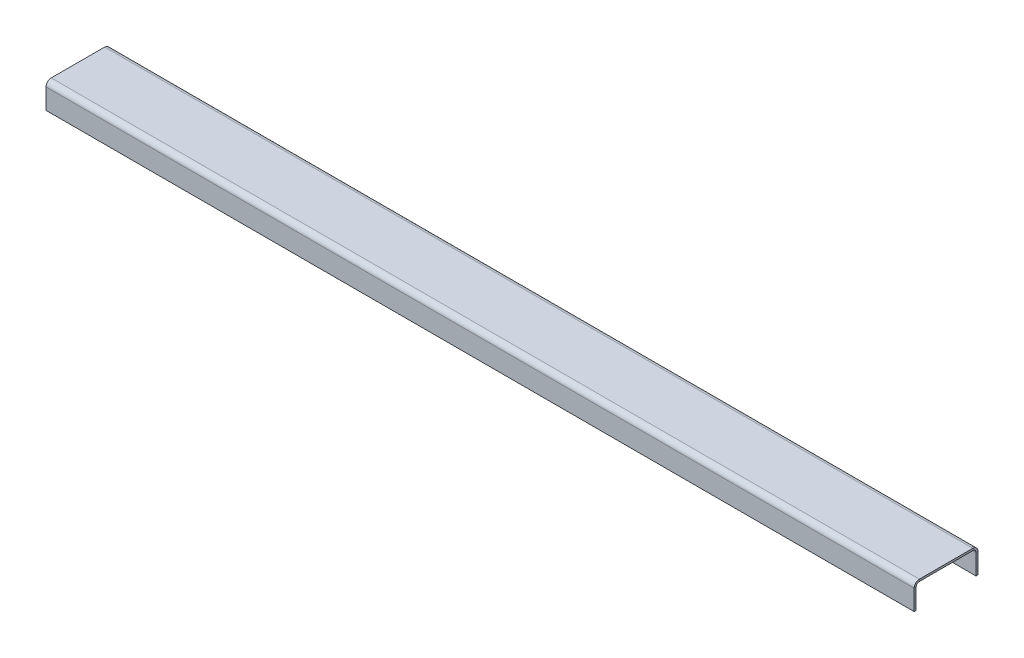
ISO-10303-21;
HEADER;
FILE_DESCRIPTION(('STEP AP214'),'2;1');
FILE_NAME('part.step','',(''),(''),'','','');
FILE_SCHEMA(('AUTOMOTIVE_DESIGN { 1 0 10303 214 1 1 1 1 }'));
ENDSEC;
DATA;
#1=APPLICATION_CONTEXT('core data for automotive mechanical design processes');
#2=APPLICATION_PROTOCOL_DEFINITION('international standard','automotive_design',2000,#1);
#3=PRODUCT_CONTEXT('',#1,'mechanical');
#4=PRODUCT('Part','Part','',(#3));
#5=PRODUCT_RELATED_PRODUCT_CATEGORY('part','',(#4));
#6=PRODUCT_DEFINITION_FORMATION('','',#4);
#7=PRODUCT_DEFINITION_CONTEXT('part definition',#1,'design');
#8=PRODUCT_DEFINITION('design','',#6,#7);
#9=PRODUCT_DEFINITION_SHAPE('','',#8);
#10=(LENGTH_UNIT() NAMED_UNIT(*) SI_UNIT(.MILLI.,.METRE.));
#11=(NAMED_UNIT(*) PLANE_ANGLE_UNIT() SI_UNIT($,.RADIAN.));
#12=(NAMED_UNIT(*) SI_UNIT($,.STERADIAN.) SOLID_ANGLE_UNIT());
#13=UNCERTAINTY_MEASURE_WITH_UNIT(LENGTH_MEASURE(1.E-05),#10,'distance_accuracy_value','');
#14=(GEOMETRIC_REPRESENTATION_CONTEXT(3) GLOBAL_UNCERTAINTY_ASSIGNED_CONTEXT((#13)) GLOBAL_UNIT_ASSIGNED_CONTEXT((#10,
#11,#12)) REPRESENTATION_CONTEXT('',''));
#15=CARTESIAN_POINT('',(0.,0.,0.));
#16=DIRECTION('',(0.,0.,1.));
#17=DIRECTION('',(1.,0.,0.));
#18=AXIS2_PLACEMENT_3D('',#15,#16,#17);
#19=CARTESIAN_POINT('',(0.,-2.032,0.));
#20=DIRECTION('',(0.,-1.,0.));
#21=DIRECTION('',(0.,0.,-1.));
#22=AXIS2_PLACEMENT_3D('',#19,#20,#21);
#23=PLANE('',#22);
#24=DIRECTION('',(0.,0.,1.));
#25=VECTOR('',#24,1.);
#26=CARTESIAN_POINT('',(0.,-2.032,0.));
#27=LINE('',#26,#25);
#28=CARTESIAN_POINT('',(0.,-2.03200000000003,-58.293));
#29=VERTEX_POINT('',#28);
#30=CARTESIAN_POINT('',(0.,-2.032,-5.20699999999993));
#31=VERTEX_POINT('',#30);
#32=EDGE_CURVE('E88',#29,#31,#27,.T.);
#33=ORIENTED_EDGE('',*,*,#32,.F.);
#34=DIRECTION('',(1.,0.,0.));
#35=VECTOR('',#34,1.);
#36=CARTESIAN_POINT('',(863.6,-2.03200000000003,-58.293));
#37=LINE('',#36,#35);
#38=CARTESIAN_POINT('',(863.6,-2.03200000000003,-58.293));
#39=VERTEX_POINT('',#38);
#40=EDGE_CURVE('E224',#39,#29,#37,.F.);
#41=ORIENTED_EDGE('',*,*,#40,.F.);
#42=DIRECTION('',(0.,0.,-1.));
#43=VECTOR('',#42,1.);
#44=CARTESIAN_POINT('',(863.6,-2.032,0.));
#45=LINE('',#44,#43);
#46=CARTESIAN_POINT('',(863.6,-2.032,-5.20699999999987));
#47=VERTEX_POINT('',#46);
#48=EDGE_CURVE('E13',#47,#39,#45,.T.);
#49=ORIENTED_EDGE('',*,*,#48,.F.);
#50=DIRECTION('',(-1.,0.,0.));
#51=VECTOR('',#50,1.);
#52=CARTESIAN_POINT('',(0.,-2.03200000000005,-5.20699999999999));
#53=LINE('',#52,#51);
#54=EDGE_CURVE('E278',#31,#47,#53,.F.);
#55=ORIENTED_EDGE('',*,*,#54,.F.);
#56=EDGE_LOOP('',(#33,#41,#49,#55));
#57=FACE_BOUND('',#56,.T.);
#58=ADVANCED_FACE('F79',(#57),#23,.T.);
#59=CARTESIAN_POINT('',(0.,0.,0.));
#60=DIRECTION('',(0.,-1.,0.));
#61=DIRECTION('',(0.,0.,-1.));
#62=AXIS2_PLACEMENT_3D('',#59,#60,#61);
#63=PLANE('',#62);
#64=DIRECTION('',(1.,0.,0.));
#65=VECTOR('',#64,1.);
#66=CARTESIAN_POINT('',(863.6,0.,-58.293));
#67=LINE('',#66,#65);
#68=CARTESIAN_POINT('',(863.6,0.,-58.293));
#69=VERTEX_POINT('',#68);
#70=CARTESIAN_POINT('',(0.,0.,-58.293));
#71=VERTEX_POINT('',#70);
#72=EDGE_CURVE('E212',#69,#71,#67,.F.);
#73=ORIENTED_EDGE('',*,*,#72,.T.);
#74=DIRECTION('',(0.,0.,1.));
#75=VECTOR('',#74,1.);
#76=CARTESIAN_POINT('',(0.,0.,0.));
#77=LINE('',#76,#75);
#78=CARTESIAN_POINT('',(0.,0.,-5.20699999999995));
#79=VERTEX_POINT('',#78);
#80=EDGE_CURVE('E284',#71,#79,#77,.T.);
#81=ORIENTED_EDGE('',*,*,#80,.T.);
#82=DIRECTION('',(-1.,0.,0.));
#83=VECTOR('',#82,1.);
#84=CARTESIAN_POINT('',(0.,0.,-5.20699999999995));
#85=LINE('',#84,#83);
#86=CARTESIAN_POINT('',(863.6,0.,-5.20699999999987));
#87=VERTEX_POINT('',#86);
#88=EDGE_CURVE('E266',#79,#87,#85,.F.);
#89=ORIENTED_EDGE('',*,*,#88,.T.);
#90=DIRECTION('',(0.,0.,-1.));
#91=VECTOR('',#90,1.);
#92=CARTESIAN_POINT('',(863.6,0.,0.));
#93=LINE('',#92,#91);
#94=EDGE_CURVE('E83',#87,#69,#93,.T.);
#95=ORIENTED_EDGE('',*,*,#94,.T.);
#96=EDGE_LOOP('',(#73,#81,#89,#95));
#97=FACE_BOUND('',#96,.T.);
#98=ADVANCED_FACE('F290',(#97),#63,.F.);
#99=CARTESIAN_POINT('',(863.6,-2.032,0.));
#100=DIRECTION('',(1.,0.,0.));
#101=DIRECTION('',(0.,0.,-1.));
#102=AXIS2_PLACEMENT_3D('',#99,#100,#101);
#103=PLANE('',#102);
#104=ORIENTED_EDGE('',*,*,#48,.T.);
#105=DIRECTION('',(0.,1.,0.));
#106=VECTOR('',#105,1.);
#107=CARTESIAN_POINT('',(863.6,-2.03200000000003,-58.293));
#108=LINE('',#107,#106);
#109=EDGE_CURVE('E218',#39,#69,#108,.T.);
#110=ORIENTED_EDGE('',*,*,#109,.T.);
#111=ORIENTED_EDGE('',*,*,#94,.F.);
#112=DIRECTION('',(0.,1.,0.));
#113=VECTOR('',#112,1.);
#114=CARTESIAN_POINT('',(863.6,-2.03200000000005,-5.20699999999987));
#115=LINE('',#114,#113);
#116=EDGE_CURVE('E95',#47,#87,#115,.T.);
#117=ORIENTED_EDGE('',*,*,#116,.F.);
#118=EDGE_LOOP('',(#104,#110,#111,#117));
#119=FACE_BOUND('',#118,.T.);
#120=ADVANCED_FACE('F293',(#119),#103,.T.);
#121=CARTESIAN_POINT('',(0.,-2.032,0.));
#122=DIRECTION('',(-1.,0.,0.));
#123=DIRECTION('',(0.,0.,1.));
#124=AXIS2_PLACEMENT_3D('',#121,#122,#123);
#125=PLANE('',#124);
#126=DIRECTION('',(0.,1.,0.));
#127=VECTOR('',#126,1.);
#128=CARTESIAN_POINT('',(0.,-2.03200000000003,-58.293));
#129=LINE('',#128,#127);
#130=EDGE_CURVE('E230',#29,#71,#129,.T.);
#131=ORIENTED_EDGE('',*,*,#130,.F.);
#132=ORIENTED_EDGE('',*,*,#32,.T.);
#133=DIRECTION('',(0.,1.,0.));
#134=VECTOR('',#133,1.);
#135=CARTESIAN_POINT('',(0.,-2.03200000000005,-5.20699999999999));
#136=LINE('',#135,#134);
#137=EDGE_CURVE('E272',#31,#79,#136,.T.);
#138=ORIENTED_EDGE('',*,*,#137,.T.);
#139=ORIENTED_EDGE('',*,*,#80,.F.);
#140=EDGE_LOOP('',(#131,#132,#138,#139));
#141=FACE_BOUND('',#140,.T.);
#142=ADVANCED_FACE('F81',(#141),#125,.T.);
#143=CARTESIAN_POINT('',(863.6,-5.20699999999999,-5.20699999999993));
#144=DIRECTION('',(1.,0.,0.));
#145=DIRECTION('',(0.,0.,-1.));
#146=AXIS2_PLACEMENT_3D('',#143,#144,#145);
#147=PLANE('',#146);
#148=DIRECTION('',(0.,0.,-1.));
#149=VECTOR('',#148,1.);
#150=CARTESIAN_POINT('',(863.6,-5.20699999999999,0.));
#151=LINE('',#150,#149);
#152=CARTESIAN_POINT('',(863.6,-5.20699999999998,-2.03199999999999));
#153=VERTEX_POINT('',#152);
#154=CARTESIAN_POINT('',(863.6,-5.20699999999997,0.));
#155=VERTEX_POINT('',#154);
#156=EDGE_CURVE('E233',#153,#155,#151,.F.);
#157=ORIENTED_EDGE('',*,*,#156,.F.);
#158=CARTESIAN_POINT('',(863.6,-5.20699999999999,-5.20699999999993));
#159=DIRECTION('',(-1.,0.,0.));
#160=DIRECTION('',(0.,0.,1.));
#161=AXIS2_PLACEMENT_3D('',#158,#159,#160);
#162=CIRCLE('',#161,3.17499999999994);
#163=EDGE_CURVE('E275',#47,#153,#162,.F.);
#164=ORIENTED_EDGE('',*,*,#163,.F.);
#165=ORIENTED_EDGE('',*,*,#116,.T.);
#166=CARTESIAN_POINT('',(863.6,-5.20699999999999,-5.20699999999993));
#167=DIRECTION('',(-1.,0.,0.));
#168=DIRECTION('',(0.,0.,1.));
#169=AXIS2_PLACEMENT_3D('',#166,#167,#168);
#170=CIRCLE('',#169,5.20699999999994);
#171=EDGE_CURVE('E268',#87,#155,#170,.F.);
#172=ORIENTED_EDGE('',*,*,#171,.T.);
#173=EDGE_LOOP('',(#157,#164,#165,#172));
#174=FACE_BOUND('',#173,.T.);
#175=ADVANCED_FACE('F345',(#174),#147,.T.);
#176=CARTESIAN_POINT('',(0.,-5.20699999999999,-5.20700000000005));
#177=DIRECTION('',(1.,0.,0.));
#178=DIRECTION('',(0.,0.,-1.));
#179=AXIS2_PLACEMENT_3D('',#176,#177,#178);
#180=PLANE('',#179);
#181=CARTESIAN_POINT('',(0.,-5.20699999999999,-5.20700000000005));
#182=DIRECTION('',(-1.,0.,0.));
#183=DIRECTION('',(0.,0.,1.));
#184=AXIS2_PLACEMENT_3D('',#181,#182,#183);
#185=CIRCLE('',#184,3.17499999999994);
#186=CARTESIAN_POINT('',(0.,-5.20699999999998,-2.03200000000011));
#187=VERTEX_POINT('',#186);
#188=EDGE_CURVE('E239',#187,#31,#185,.T.);
#189=ORIENTED_EDGE('',*,*,#188,.F.);
#190=DIRECTION('',(0.,0.,-1.));
#191=VECTOR('',#190,1.);
#192=CARTESIAN_POINT('',(0.,-5.20699999999999,-2.03199999999999));
#193=LINE('',#192,#191);
#194=CARTESIAN_POINT('',(0.,-5.20699999999999,0.));
#195=VERTEX_POINT('',#194);
#196=EDGE_CURVE('E259',#187,#195,#193,.F.);
#197=ORIENTED_EDGE('',*,*,#196,.T.);
#198=CARTESIAN_POINT('',(0.,-5.20699999999999,-5.20700000000005));
#199=DIRECTION('',(-1.,0.,0.));
#200=DIRECTION('',(0.,0.,1.));
#201=AXIS2_PLACEMENT_3D('',#198,#199,#200);
#202=CIRCLE('',#201,5.20699999999994);
#203=EDGE_CURVE('E269',#195,#79,#202,.T.);
#204=ORIENTED_EDGE('',*,*,#203,.T.);
#205=ORIENTED_EDGE('',*,*,#137,.F.);
#206=EDGE_LOOP('',(#189,#197,#204,#205));
#207=FACE_BOUND('',#206,.T.);
#208=ADVANCED_FACE('F318',(#207),#180,.F.);
#209=CARTESIAN_POINT('',(0.,-5.20699999999999,-5.20700000000005));
#210=DIRECTION('',(-1.,0.,0.));
#211=DIRECTION('',(0.,0.,1.));
#212=AXIS2_PLACEMENT_3D('',#209,#210,#211);
#213=CYLINDRICAL_SURFACE('',#212,5.20699999999994);
#214=ORIENTED_EDGE('',*,*,#88,.F.);
#215=ORIENTED_EDGE('',*,*,#203,.F.);
#216=DIRECTION('',(-1.,0.,0.));
#217=VECTOR('',#216,1.);
#218=CARTESIAN_POINT('',(863.6,-5.20699999999999,0.));
#219=LINE('',#218,#217);
#220=EDGE_CURVE('E257',#195,#155,#219,.F.);
#221=ORIENTED_EDGE('',*,*,#220,.T.);
#222=ORIENTED_EDGE('',*,*,#171,.F.);
#223=EDGE_LOOP('',(#214,#215,#221,#222));
#224=FACE_BOUND('',#223,.T.);
#225=ADVANCED_FACE('F343',(#224),#213,.T.);
#226=CARTESIAN_POINT('',(0.,-5.20699999999999,-5.20700000000005));
#227=DIRECTION('',(-1.,0.,0.));
#228=DIRECTION('',(0.,0.,1.));
#229=AXIS2_PLACEMENT_3D('',#226,#227,#228);
#230=CYLINDRICAL_SURFACE('',#229,3.17499999999994);
#231=ORIENTED_EDGE('',*,*,#54,.T.);
#232=ORIENTED_EDGE('',*,*,#163,.T.);
#233=DIRECTION('',(-1.,0.,0.));
#234=VECTOR('',#233,1.);
#235=CARTESIAN_POINT('',(863.6,-5.20699999999999,-2.03199999999999));
#236=LINE('',#235,#234);
#237=EDGE_CURVE('E262',#153,#187,#236,.T.);
#238=ORIENTED_EDGE('',*,*,#237,.T.);
#239=ORIENTED_EDGE('',*,*,#188,.T.);
#240=EDGE_LOOP('',(#231,#232,#238,#239));
#241=FACE_BOUND('',#240,.T.);
#242=ADVANCED_FACE('F320',(#241),#230,.F.);
#243=CARTESIAN_POINT('',(0.,-25.4,0.));
#244=DIRECTION('',(1.,0.,0.));
#245=DIRECTION('',(0.,0.,-1.));
#246=AXIS2_PLACEMENT_3D('',#243,#244,#245);
#247=PLANE('',#246);
#248=ORIENTED_EDGE('',*,*,#196,.F.);
#249=DIRECTION('',(0.,1.,0.));
#250=VECTOR('',#249,1.);
#251=CARTESIAN_POINT('',(0.,-25.4,-2.03199999999992));
#252=LINE('',#251,#250);
#253=CARTESIAN_POINT('',(0.,-25.4,-2.03199999999992));
#254=VERTEX_POINT('',#253);
#255=EDGE_CURVE('E255',#187,#254,#252,.F.);
#256=ORIENTED_EDGE('',*,*,#255,.T.);
#257=DIRECTION('',(0.,0.,-1.));
#258=VECTOR('',#257,1.);
#259=CARTESIAN_POINT('',(0.,-25.4,0.));
#260=LINE('',#259,#258);
#261=CARTESIAN_POINT('',(0.,-25.4,0.));
#262=VERTEX_POINT('',#261);
#263=EDGE_CURVE('E236',#262,#254,#260,.T.);
#264=ORIENTED_EDGE('',*,*,#263,.F.);
#265=DIRECTION('',(0.,-1.,0.));
#266=VECTOR('',#265,1.);
#267=CARTESIAN_POINT('',(0.,0.,0.));
#268=LINE('',#267,#266);
#269=EDGE_CURVE('E248',#195,#262,#268,.T.);
#270=ORIENTED_EDGE('',*,*,#269,.F.);
#271=EDGE_LOOP('',(#248,#256,#264,#270));
#272=FACE_BOUND('',#271,.T.);
#273=ADVANCED_FACE('F337',(#272),#247,.F.);
#274=CARTESIAN_POINT('',(863.6,-2.03199999999999,0.));
#275=DIRECTION('',(-1.,0.,0.));
#276=DIRECTION('',(0.,0.,1.));
#277=AXIS2_PLACEMENT_3D('',#274,#275,#276);
#278=PLANE('',#277);
#279=ORIENTED_EDGE('',*,*,#156,.T.);
#280=DIRECTION('',(0.,1.,0.));
#281=VECTOR('',#280,1.);
#282=CARTESIAN_POINT('',(863.6,0.,0.));
#283=LINE('',#282,#281);
#284=CARTESIAN_POINT('',(863.6,-25.4,0.));
#285=VERTEX_POINT('',#284);
#286=EDGE_CURVE('E243',#285,#155,#283,.T.);
#287=ORIENTED_EDGE('',*,*,#286,.F.);
#288=DIRECTION('',(0.,0.,-1.));
#289=VECTOR('',#288,1.);
#290=CARTESIAN_POINT('',(863.6,-25.4,0.));
#291=LINE('',#290,#289);
#292=CARTESIAN_POINT('',(863.6,-25.4,-2.03199999999992));
#293=VERTEX_POINT('',#292);
#294=EDGE_CURVE('E240',#285,#293,#291,.T.);
#295=ORIENTED_EDGE('',*,*,#294,.T.);
#296=DIRECTION('',(0.,-1.,0.));
#297=VECTOR('',#296,1.);
#298=CARTESIAN_POINT('',(863.6,-2.032,-2.032));
#299=LINE('',#298,#297);
#300=EDGE_CURVE('E250',#293,#153,#299,.F.);
#301=ORIENTED_EDGE('',*,*,#300,.T.);
#302=EDGE_LOOP('',(#279,#287,#295,#301));
#303=FACE_BOUND('',#302,.T.);
#304=ADVANCED_FACE('F328',(#303),#278,.F.);
#305=CARTESIAN_POINT('',(0.,0.,0.));
#306=DIRECTION('',(0.,0.,-1.));
#307=DIRECTION('',(0.,1.,0.));
#308=AXIS2_PLACEMENT_3D('',#305,#306,#307);
#309=PLANE('',#308);
#310=ORIENTED_EDGE('',*,*,#220,.F.);
#311=ORIENTED_EDGE('',*,*,#269,.T.);
#312=DIRECTION('',(1.,0.,0.));
#313=VECTOR('',#312,1.);
#314=CARTESIAN_POINT('',(0.,-25.4,0.));
#315=LINE('',#314,#313);
#316=EDGE_CURVE('E246',#262,#285,#315,.T.);
#317=ORIENTED_EDGE('',*,*,#316,.T.);
#318=ORIENTED_EDGE('',*,*,#286,.T.);
#319=EDGE_LOOP('',(#310,#311,#317,#318));
#320=FACE_BOUND('',#319,.T.);
#321=ADVANCED_FACE('F340',(#320),#309,.F.);
#322=CARTESIAN_POINT('',(0.,0.,-2.03200000000001));
#323=DIRECTION('',(0.,0.,-1.));
#324=DIRECTION('',(0.,1.,0.));
#325=AXIS2_PLACEMENT_3D('',#322,#323,#324);
#326=PLANE('',#325);
#327=ORIENTED_EDGE('',*,*,#255,.F.);
#328=ORIENTED_EDGE('',*,*,#237,.F.);
#329=ORIENTED_EDGE('',*,*,#300,.F.);
#330=DIRECTION('',(-1.,0.,0.));
#331=VECTOR('',#330,1.);
#332=CARTESIAN_POINT('',(863.6,-25.4,-2.03199999999992));
#333=LINE('',#332,#331);
#334=EDGE_CURVE('E253',#254,#293,#333,.F.);
#335=ORIENTED_EDGE('',*,*,#334,.F.);
#336=EDGE_LOOP('',(#327,#328,#329,#335));
#337=FACE_BOUND('',#336,.T.);
#338=ADVANCED_FACE('F325',(#337),#326,.T.);
#339=CARTESIAN_POINT('',(863.6,-25.4,0.));
#340=DIRECTION('',(0.,1.,0.));
#341=DIRECTION('',(0.,0.,1.));
#342=AXIS2_PLACEMENT_3D('',#339,#340,#341);
#343=PLANE('',#342);
#344=ORIENTED_EDGE('',*,*,#334,.T.);
#345=ORIENTED_EDGE('',*,*,#294,.F.);
#346=ORIENTED_EDGE('',*,*,#316,.F.);
#347=ORIENTED_EDGE('',*,*,#263,.T.);
#348=EDGE_LOOP('',(#344,#345,#346,#347));
#349=FACE_BOUND('',#348,.T.);
#350=ADVANCED_FACE('F333',(#349),#343,.F.);
#351=CARTESIAN_POINT('',(0.,-5.20700000000003,-58.293));
#352=DIRECTION('',(-1.,0.,0.));
#353=DIRECTION('',(0.,0.,1.));
#354=AXIS2_PLACEMENT_3D('',#351,#352,#353);
#355=PLANE('',#354);
#356=DIRECTION('',(0.,0.,1.));
#357=VECTOR('',#356,1.);
#358=CARTESIAN_POINT('',(0.,-5.20699999999999,-63.5));
#359=LINE('',#358,#357);
#360=CARTESIAN_POINT('',(0.,-5.20700000000001,-61.468));
#361=VERTEX_POINT('',#360);
#362=CARTESIAN_POINT('',(0.,-5.20700000000001,-63.5));
#363=VERTEX_POINT('',#362);
#364=EDGE_CURVE('E194',#361,#363,#359,.F.);
#365=ORIENTED_EDGE('',*,*,#364,.F.);
#366=CARTESIAN_POINT('',(0.,-5.20700000000003,-58.293));
#367=DIRECTION('',(1.,0.,0.));
#368=DIRECTION('',(0.,0.,-1.));
#369=AXIS2_PLACEMENT_3D('',#366,#367,#368);
#370=CIRCLE('',#369,3.175);
#371=EDGE_CURVE('E221',#29,#361,#370,.F.);
#372=ORIENTED_EDGE('',*,*,#371,.F.);
#373=ORIENTED_EDGE('',*,*,#130,.T.);
#374=CARTESIAN_POINT('',(0.,-5.20700000000003,-58.293));
#375=DIRECTION('',(1.,0.,0.));
#376=DIRECTION('',(0.,0.,-1.));
#377=AXIS2_PLACEMENT_3D('',#374,#375,#376);
#378=CIRCLE('',#377,5.207);
#379=EDGE_CURVE('E214',#71,#363,#378,.F.);
#380=ORIENTED_EDGE('',*,*,#379,.T.);
#381=EDGE_LOOP('',(#365,#372,#373,#380));
#382=FACE_BOUND('',#381,.T.);
#383=ADVANCED_FACE('F311',(#382),#355,.T.);
#384=CARTESIAN_POINT('',(863.6,-5.20700000000003,-58.293));
#385=DIRECTION('',(-1.,0.,0.));
#386=DIRECTION('',(0.,0.,1.));
#387=AXIS2_PLACEMENT_3D('',#384,#385,#386);
#388=PLANE('',#387);
#389=CARTESIAN_POINT('',(863.6,-5.20700000000003,-58.293));
#390=DIRECTION('',(1.,0.,0.));
#391=DIRECTION('',(0.,0.,-1.));
#392=AXIS2_PLACEMENT_3D('',#389,#390,#391);
#393=CIRCLE('',#392,3.175);
#394=CARTESIAN_POINT('',(863.6,-5.20700000000001,-61.468));
#395=VERTEX_POINT('',#394);
#396=EDGE_CURVE('E227',#395,#39,#393,.T.);
#397=ORIENTED_EDGE('',*,*,#396,.F.);
#398=DIRECTION('',(0.,0.,1.));
#399=VECTOR('',#398,1.);
#400=CARTESIAN_POINT('',(863.6,-5.207,-61.468));
#401=LINE('',#400,#399);
#402=CARTESIAN_POINT('',(863.6,-5.20699999999999,-63.5));
#403=VERTEX_POINT('',#402);
#404=EDGE_CURVE('E206',#395,#403,#401,.F.);
#405=ORIENTED_EDGE('',*,*,#404,.T.);
#406=CARTESIAN_POINT('',(863.6,-5.20700000000003,-58.293));
#407=DIRECTION('',(1.,0.,0.));
#408=DIRECTION('',(0.,0.,-1.));
#409=AXIS2_PLACEMENT_3D('',#406,#407,#408);
#410=CIRCLE('',#409,5.207);
#411=EDGE_CURVE('E215',#403,#69,#410,.T.);
#412=ORIENTED_EDGE('',*,*,#411,.T.);
#413=ORIENTED_EDGE('',*,*,#109,.F.);
#414=EDGE_LOOP('',(#397,#405,#412,#413));
#415=FACE_BOUND('',#414,.T.);
#416=ADVANCED_FACE('F299',(#415),#388,.F.);
#417=CARTESIAN_POINT('',(863.6,-5.20700000000003,-58.293));
#418=DIRECTION('',(1.,0.,0.));
#419=DIRECTION('',(0.,0.,-1.));
#420=AXIS2_PLACEMENT_3D('',#417,#418,#419);
#421=CYLINDRICAL_SURFACE('',#420,5.207);
#422=ORIENTED_EDGE('',*,*,#72,.F.);
#423=ORIENTED_EDGE('',*,*,#411,.F.);
#424=DIRECTION('',(1.,0.,0.));
#425=VECTOR('',#424,1.);
#426=CARTESIAN_POINT('',(0.,-5.20699999999999,-63.5));
#427=LINE('',#426,#425);
#428=EDGE_CURVE('E204',#403,#363,#427,.F.);
#429=ORIENTED_EDGE('',*,*,#428,.T.);
#430=ORIENTED_EDGE('',*,*,#379,.F.);
#431=EDGE_LOOP('',(#422,#423,#429,#430));
#432=FACE_BOUND('',#431,.T.);
#433=ADVANCED_FACE('F298',(#432),#421,.T.);
#434=CARTESIAN_POINT('',(863.6,-5.20700000000003,-58.293));
#435=DIRECTION('',(1.,0.,0.));
#436=DIRECTION('',(0.,0.,-1.));
#437=AXIS2_PLACEMENT_3D('',#434,#435,#436);
#438=CYLINDRICAL_SURFACE('',#437,3.175);
#439=ORIENTED_EDGE('',*,*,#40,.T.);
#440=ORIENTED_EDGE('',*,*,#371,.T.);
#441=DIRECTION('',(1.,0.,0.));
#442=VECTOR('',#441,1.);
#443=CARTESIAN_POINT('',(0.,-5.207,-61.468));
#444=LINE('',#443,#442);
#445=EDGE_CURVE('E209',#361,#395,#444,.T.);
#446=ORIENTED_EDGE('',*,*,#445,.T.);
#447=ORIENTED_EDGE('',*,*,#396,.T.);
#448=EDGE_LOOP('',(#439,#440,#446,#447));
#449=FACE_BOUND('',#448,.T.);
#450=ADVANCED_FACE('F308',(#449),#438,.F.);
#451=CARTESIAN_POINT('',(863.6,-25.4,-63.5000000000001));
#452=DIRECTION('',(-1.,0.,0.));
#453=DIRECTION('',(0.,0.,1.));
#454=AXIS2_PLACEMENT_3D('',#451,#452,#453);
#455=PLANE('',#454);
#456=ORIENTED_EDGE('',*,*,#404,.F.);
#457=DIRECTION('',(0.,1.,0.));
#458=VECTOR('',#457,1.);
#459=CARTESIAN_POINT('',(863.6,-25.4,-61.4680000000001));
#460=LINE('',#459,#458);
#461=CARTESIAN_POINT('',(863.6,-25.4,-61.4680000000001));
#462=VERTEX_POINT('',#461);
#463=EDGE_CURVE('E202',#395,#462,#460,.F.);
#464=ORIENTED_EDGE('',*,*,#463,.T.);
#465=DIRECTION('',(0.,0.,1.));
#466=VECTOR('',#465,1.);
#467=CARTESIAN_POINT('',(863.6,-25.4,-63.5000000000001));
#468=LINE('',#467,#466);
#469=CARTESIAN_POINT('',(863.6,-25.4,-63.5000000000001));
#470=VERTEX_POINT('',#469);
#471=EDGE_CURVE('E190',#470,#462,#468,.T.);
#472=ORIENTED_EDGE('',*,*,#471,.F.);
#473=DIRECTION('',(0.,-1.,0.));
#474=VECTOR('',#473,1.);
#475=CARTESIAN_POINT('',(863.6,2.33362969555765E-13,-63.5));
#476=LINE('',#475,#474);
#477=EDGE_CURVE('E177',#403,#470,#476,.T.);
#478=ORIENTED_EDGE('',*,*,#477,.F.);
#479=EDGE_LOOP('',(#456,#464,#472,#478));
#480=FACE_BOUND('',#479,.T.);
#481=ADVANCED_FACE('F303',(#480),#455,.F.);
#482=CARTESIAN_POINT('',(0.,-2.03199999999999,-63.5));
#483=DIRECTION('',(1.,0.,0.));
#484=DIRECTION('',(0.,0.,-1.));
#485=AXIS2_PLACEMENT_3D('',#482,#483,#484);
#486=PLANE('',#485);
#487=ORIENTED_EDGE('',*,*,#364,.T.);
#488=DIRECTION('',(0.,1.,0.));
#489=VECTOR('',#488,1.);
#490=CARTESIAN_POINT('',(0.,2.33362969555765E-13,-63.5));
#491=LINE('',#490,#489);
#492=CARTESIAN_POINT('',(0.,-25.4,-63.5000000000001));
#493=VERTEX_POINT('',#492);
#494=EDGE_CURVE('E175',#493,#363,#491,.T.);
#495=ORIENTED_EDGE('',*,*,#494,.F.);
#496=DIRECTION('',(0.,0.,1.));
#497=VECTOR('',#496,1.);
#498=CARTESIAN_POINT('',(0.,-25.4,-63.5000000000001));
#499=LINE('',#498,#497);
#500=CARTESIAN_POINT('',(0.,-25.4,-61.4680000000001));
#501=VERTEX_POINT('',#500);
#502=EDGE_CURVE('E183',#493,#501,#499,.T.);
#503=ORIENTED_EDGE('',*,*,#502,.T.);
#504=DIRECTION('',(0.,-1.,0.));
#505=VECTOR('',#504,1.);
#506=CARTESIAN_POINT('',(0.,-2.032,-61.468));
#507=LINE('',#506,#505);
#508=EDGE_CURVE('E199',#501,#361,#507,.F.);
#509=ORIENTED_EDGE('',*,*,#508,.T.);
#510=EDGE_LOOP('',(#487,#495,#503,#509));
#511=FACE_BOUND('',#510,.T.);
#512=ADVANCED_FACE('F193',(#511),#486,.F.);
#513=CARTESIAN_POINT('',(0.,2.33362969555765E-13,-63.5));
#514=DIRECTION('',(0.,0.,1.));
#515=DIRECTION('',(0.,-1.,0.));
#516=AXIS2_PLACEMENT_3D('',#513,#514,#515);
#517=PLANE('',#516);
#518=ORIENTED_EDGE('',*,*,#428,.F.);
#519=ORIENTED_EDGE('',*,*,#477,.T.);
#520=DIRECTION('',(-1.,0.,0.));
#521=VECTOR('',#520,1.);
#522=CARTESIAN_POINT('',(0.,-25.4,-63.5000000000001));
#523=LINE('',#522,#521);
#524=EDGE_CURVE('E170',#470,#493,#523,.T.);
#525=ORIENTED_EDGE('',*,*,#524,.T.);
#526=ORIENTED_EDGE('',*,*,#494,.T.);
#527=EDGE_LOOP('',(#518,#519,#525,#526));
#528=FACE_BOUND('',#527,.T.);
#529=ADVANCED_FACE('F173',(#528),#517,.F.);
#530=CARTESIAN_POINT('',(0.,2.26268279475236E-13,-61.468));
#531=DIRECTION('',(0.,0.,1.));
#532=DIRECTION('',(0.,-1.,0.));
#533=AXIS2_PLACEMENT_3D('',#530,#531,#532);
#534=PLANE('',#533);
#535=ORIENTED_EDGE('',*,*,#463,.F.);
#536=ORIENTED_EDGE('',*,*,#445,.F.);
#537=ORIENTED_EDGE('',*,*,#508,.F.);
#538=DIRECTION('',(1.,0.,0.));
#539=VECTOR('',#538,1.);
#540=CARTESIAN_POINT('',(0.,-25.4,-61.4680000000001));
#541=LINE('',#540,#539);
#542=EDGE_CURVE('E186',#462,#501,#541,.F.);
#543=ORIENTED_EDGE('',*,*,#542,.F.);
#544=EDGE_LOOP('',(#535,#536,#537,#543));
#545=FACE_BOUND('',#544,.T.);
#546=ADVANCED_FACE('F306',(#545),#534,.T.);
#547=CARTESIAN_POINT('',(0.,-25.4,-63.5000000000001));
#548=DIRECTION('',(0.,1.,0.));
#549=DIRECTION('',(0.,0.,1.));
#550=AXIS2_PLACEMENT_3D('',#547,#548,#549);
#551=PLANE('',#550);
#552=ORIENTED_EDGE('',*,*,#542,.T.);
#553=ORIENTED_EDGE('',*,*,#502,.F.);
#554=ORIENTED_EDGE('',*,*,#524,.F.);
#555=ORIENTED_EDGE('',*,*,#471,.T.);
#556=EDGE_LOOP('',(#552,#553,#554,#555));
#557=FACE_BOUND('',#556,.T.);
#558=ADVANCED_FACE('F184',(#557),#551,.F.);
#559=CLOSED_SHELL('',(#58,#98,#120,#142,#175,#208,#225,#242,#273,#304,#321,#338,#350,#383,#416,
#433,#450,#481,#512,#529,#546,#558));
#560=MANIFOLD_SOLID_BREP('B2',#559);
#561=ADVANCED_BREP_SHAPE_REPRESENTATION('',(#18,#560),#14);
#562=SHAPE_DEFINITION_REPRESENTATION(#9,#561);
ENDSEC;
END-ISO-10303-21;
